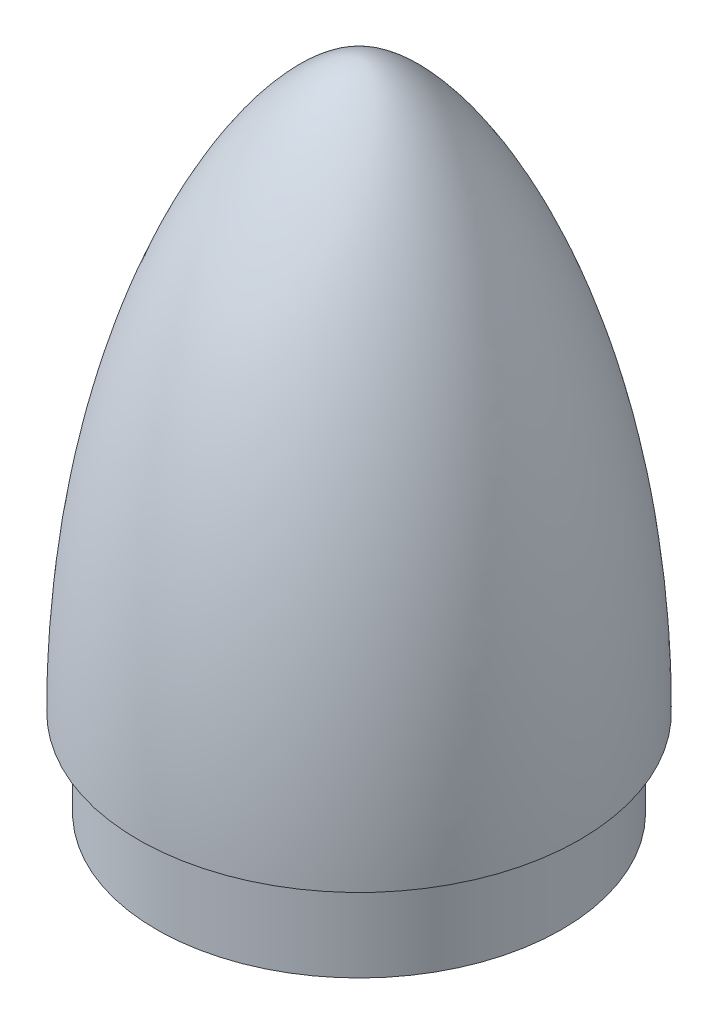
ISO-10303-21;
HEADER;
FILE_DESCRIPTION(('STEP AP214'),'2;1');
FILE_NAME('part.step','',(''),(''),'','','');
FILE_SCHEMA(('AUTOMOTIVE_DESIGN { 1 0 10303 214 1 1 1 1 }'));
ENDSEC;
DATA;
#1=APPLICATION_CONTEXT('core data for automotive mechanical design processes');
#2=APPLICATION_PROTOCOL_DEFINITION('international standard','automotive_design',2000,#1);
#3=PRODUCT_CONTEXT('',#1,'mechanical');
#4=PRODUCT('Part','Part','',(#3));
#5=PRODUCT_RELATED_PRODUCT_CATEGORY('part','',(#4));
#6=PRODUCT_DEFINITION_FORMATION('','',#4);
#7=PRODUCT_DEFINITION_CONTEXT('part definition',#1,'design');
#8=PRODUCT_DEFINITION('design','',#6,#7);
#9=PRODUCT_DEFINITION_SHAPE('','',#8);
#10=(LENGTH_UNIT() NAMED_UNIT(*) SI_UNIT(.MILLI.,.METRE.));
#11=(NAMED_UNIT(*) PLANE_ANGLE_UNIT() SI_UNIT($,.RADIAN.));
#12=(NAMED_UNIT(*) SI_UNIT($,.STERADIAN.) SOLID_ANGLE_UNIT());
#13=UNCERTAINTY_MEASURE_WITH_UNIT(LENGTH_MEASURE(1.E-05),#10,'distance_accuracy_value','');
#14=(GEOMETRIC_REPRESENTATION_CONTEXT(3) GLOBAL_UNCERTAINTY_ASSIGNED_CONTEXT((#13)) GLOBAL_UNIT_ASSIGNED_CONTEXT((#10,
#11,#12)) REPRESENTATION_CONTEXT('',''));
#15=CARTESIAN_POINT('',(0.,0.,0.));
#16=DIRECTION('',(0.,0.,1.));
#17=DIRECTION('',(1.,0.,0.));
#18=AXIS2_PLACEMENT_3D('',#15,#16,#17);
#19=CARTESIAN_POINT('',(23.3,11.2,0.));
#20=DIRECTION('',(0.,1.,0.));
#21=DIRECTION('',(-1.,0.,0.));
#22=AXIS2_PLACEMENT_3D('',#19,#20,#21);
#23=PLANE('',#22);
#24=DIRECTION('',(1.,0.,0.));
#25=VECTOR('',#24,1.);
#26=CARTESIAN_POINT('',(-24.1741484317915,11.2,-1.));
#27=LINE('',#26,#25);
#28=CARTESIAN_POINT('',(22.0773639730834,11.2,-1.));
#29=VERTEX_POINT('',#28);
#30=CARTESIAN_POINT('',(24.1741484317915,11.2,-1.));
#31=VERTEX_POINT('',#30);
#32=EDGE_CURVE('E173',#29,#31,#27,.T.);
#33=ORIENTED_EDGE('',*,*,#32,.T.);
#34=CARTESIAN_POINT('',(0.,11.2,0.));
#35=DIRECTION('',(0.,-1.,0.));
#36=DIRECTION('',(1.,0.,0.));
#37=AXIS2_PLACEMENT_3D('',#34,#35,#36);
#38=CIRCLE('',#37,24.1948228429614);
#39=CARTESIAN_POINT('',(-24.1741484317915,11.2,-1.));
#40=VERTEX_POINT('',#39);
#41=EDGE_CURVE('E257',#40,#31,#38,.T.);
#42=ORIENTED_EDGE('',*,*,#41,.F.);
#43=CARTESIAN_POINT('',(-22.0773639730834,11.2,-1.));
#44=VERTEX_POINT('',#43);
#45=EDGE_CURVE('E243',#40,#44,#27,.T.);
#46=ORIENTED_EDGE('',*,*,#45,.T.);
#47=CARTESIAN_POINT('',(0.,11.2,0.));
#48=DIRECTION('',(0.,1.,0.));
#49=DIRECTION('',(-1.,0.,0.));
#50=AXIS2_PLACEMENT_3D('',#47,#48,#49);
#51=CIRCLE('',#50,22.1);
#52=EDGE_CURVE('E50',#44,#29,#51,.F.);
#53=ORIENTED_EDGE('',*,*,#52,.T.);
#54=EDGE_LOOP('',(#33,#42,#46,#53));
#55=FACE_BOUND('',#54,.T.);
#56=ADVANCED_FACE('F41',(#55),#23,.T.);
#57=CARTESIAN_POINT('',(0.,75.,0.));
#58=CARTESIAN_POINT('',(8.33333333333328,75.,0.));
#59=CARTESIAN_POINT('',(25.4,50.0000000000003,0.));
#60=CARTESIAN_POINT('',(25.4,9.99999999999995,0.));
#61=(BOUNDED_CURVE() B_SPLINE_CURVE(3,(#57,#58,#59,#60),.UNSPECIFIED.,.F.,
.F.) B_SPLINE_CURVE_WITH_KNOTS((4,4),(0.,1.),
.UNSPECIFIED.) CURVE() GEOMETRIC_REPRESENTATION_ITEM() RATIONAL_B_SPLINE_CURVE((1.,1.,1.,1.)) REPRESENTATION_ITEM(''));
#62=CARTESIAN_POINT('',(0.,75.,0.));
#63=DIRECTION('',(0.,-1.,0.));
#64=AXIS1_PLACEMENT('',#62,#63);
#65=SURFACE_OF_REVOLUTION('',#61,#64);
#66=OFFSET_SURFACE('',#65,-1.2,.F.);
#67=CARTESIAN_POINT('',(24.1741484317915,11.2,-1.));
#68=CARTESIAN_POINT('',(24.1639942726645,12.3736738048413,-1.));
#69=CARTESIAN_POINT('',(24.1389042804978,13.5472388097255,-1.));
#70=CARTESIAN_POINT('',(24.0581480548474,15.8935638942139,-1.));
#71=CARTESIAN_POINT('',(24.0024752984746,17.0663237486435,-1.));
#72=CARTESIAN_POINT('',(23.8598479906583,19.410027138415,-1.));
#73=CARTESIAN_POINT('',(23.7728913706183,20.5809705485041,-1.));
#74=CARTESIAN_POINT('',(23.5666593933699,22.923379803315,-1.));
#75=CARTESIAN_POINT('',(23.4472925645998,24.094837612553,-1.));
#76=CARTESIAN_POINT('',(23.1755564957163,26.433869332952,-1.));
#77=CARTESIAN_POINT('',(23.0231890233108,27.6014434487464,-1.));
#78=CARTESIAN_POINT('',(22.6845803030227,29.9316454123773,-0.999999999999999));
#79=CARTESIAN_POINT('',(22.4983395472117,31.0942733318154,-0.999999999999997));
#80=CARTESIAN_POINT('',(22.0202706556455,33.8162548575349,-0.999999999999996));
#81=CARTESIAN_POINT('',(21.7142366674177,35.3731446287377,-0.999999999999999));
#82=CARTESIAN_POINT('',(21.0361429392846,38.4728330343382,-1.));
#83=CARTESIAN_POINT('',(20.6640691193769,40.0156285898819,-1.));
#84=CARTESIAN_POINT('',(19.8503438556694,43.0838999604935,-1.));
#85=CARTESIAN_POINT('',(19.4086514898593,44.6093650196651,-1.));
#86=CARTESIAN_POINT('',(18.6900477834926,46.8826676512257,-1.));
#87=CARTESIAN_POINT('',(18.4406738109487,47.6392890179999,-1.));
#88=CARTESIAN_POINT('',(17.922696231231,49.1459091027078,-1.));
#89=CARTESIAN_POINT('',(17.6540934534144,49.895908104705,-1.));
#90=CARTESIAN_POINT('',(17.0969998714553,51.3881140903452,-1.));
#91=CARTESIAN_POINT('',(16.8085178444764,52.1303243482132,-1.));
#92=CARTESIAN_POINT('',(16.2106217397485,53.6063067661789,-1.));
#93=CARTESIAN_POINT('',(15.9012070481617,54.3400786780882,-1.));
#94=CARTESIAN_POINT('',(15.2607065978334,55.7971027853509,-0.999999999999999));
#95=CARTESIAN_POINT('',(14.9296463608352,56.5203661831969,-0.999999999999998));
#96=CARTESIAN_POINT('',(14.2441954517494,57.9557022318114,-1.));
#97=CARTESIAN_POINT('',(13.8898070856223,58.667775980071,-1.00000000000001));
#98=CARTESIAN_POINT('',(13.2463911344784,59.9050010275431,-1.00000000000001));
#99=CARTESIAN_POINT('',(12.9627790862713,60.4329712103894,-1.));
#100=CARTESIAN_POINT('',(12.3803626082366,61.4805584497362,-0.999999999999998));
#101=CARTESIAN_POINT('',(12.081556562721,62.0001746101278,-1.));
#102=CARTESIAN_POINT('',(11.4674602599168,63.0300674003089,-1.));
#103=CARTESIAN_POINT('',(11.1521591152464,63.5403375536485,-1.));
#104=CARTESIAN_POINT('',(10.5033643962672,64.5503057886138,-1.));
#105=CARTESIAN_POINT('',(10.1698437241366,65.049986499427,-1.));
#106=CARTESIAN_POINT('',(9.48627212420787,66.031474473349,-1.));
#107=CARTESIAN_POINT('',(9.13639258229692,66.513400364719,-1.));
#108=CARTESIAN_POINT('',(8.59552483407501,67.2239626326943,-1.));
#109=CARTESIAN_POINT('',(8.41257847963364,67.4587411830051,-1.));
#110=CARTESIAN_POINT('',(8.04095730102719,67.9237136381775,-1.));
#111=CARTESIAN_POINT('',(7.85228275112115,68.1539077616648,-1.));
#112=CARTESIAN_POINT('',(7.4691426512131,68.6087057218199,-1.));
#113=CARTESIAN_POINT('',(7.27468844694246,68.8333191029233,-1.));
#114=CARTESIAN_POINT('',(6.87918348840871,69.2766437309895,-1.));
#115=CARTESIAN_POINT('',(6.67813323774763,69.4953554262276,-1.));
#116=CARTESIAN_POINT('',(6.26917972248559,69.9256073287795,-1.));
#117=CARTESIAN_POINT('',(6.06128828665294,70.137158751236,-0.999999999999999));
#118=CARTESIAN_POINT('',(5.63767169756198,70.5522380087866,-1.));
#119=CARTESIAN_POINT('',(5.42194764156628,70.7557669594716,-1.));
#120=CARTESIAN_POINT('',(4.98163088150989,71.1533753895715,-1.));
#121=CARTESIAN_POINT('',(4.75703147975243,71.3474474759487,-1.));
#122=CARTESIAN_POINT('',(4.29796065400101,71.7238779933168,-0.999999999999999));
#123=CARTESIAN_POINT('',(4.06348496875789,71.9062312805773,-1.));
#124=CARTESIAN_POINT('',(3.70351923351359,72.1684577056363,-1.));
#125=CARTESIAN_POINT('',(3.58213999739629,72.2539923276645,-1.));
#126=CARTESIAN_POINT('',(3.33644978073532,72.4207313611176,-1.));
#127=CARTESIAN_POINT('',(3.21213912302124,72.5019362461824,-1.));
#128=CARTESIAN_POINT('',(2.96046898091645,72.659300383487,-1.));
#129=CARTESIAN_POINT('',(2.83311158071216,72.7354629578399,-1.));
#130=CARTESIAN_POINT('',(2.57509201411336,72.8819359584576,-1.));
#131=CARTESIAN_POINT('',(2.44443050880844,72.9522475435034,-1.));
#132=CARTESIAN_POINT('',(2.17876160426905,73.0863611326541,-1.));
#133=CARTESIAN_POINT('',(2.04373217322909,73.1501197762908,-1.));
#134=CARTESIAN_POINT('',(1.76993676500968,73.2691806075087,-0.999999999999999));
#135=CARTESIAN_POINT('',(1.6311703021423,73.3244816895935,-0.999999999999998));
#136=CARTESIAN_POINT('',(1.35059386678707,73.4244627982564,-1.));
#137=CARTESIAN_POINT('',(1.20880230817291,73.4691939262656,-1.00000000000001));
#138=CARTESIAN_POINT('',(0.921777642420606,73.5459300765969,-0.999999999999994));
#139=CARTESIAN_POINT('',(0.776546260008409,73.5779413392822,-0.999999999999978));
#140=CARTESIAN_POINT('',(0.554589619324789,73.614660687757,-0.999999999999987));
#141=CARTESIAN_POINT('',(0.478791382609629,73.6250814597416,-0.999999999999997));
#142=CARTESIAN_POINT('',(0.326711140755808,73.6414512651248,-1.));
#143=CARTESIAN_POINT('',(0.250429188371628,73.6474007779835,-1.));
#144=CARTESIAN_POINT('',(0.0976664467864248,73.6545861156783,-0.999999999999999));
#145=CARTESIAN_POINT('',(0.0211857292079774,73.6558234517748,-1.));
#146=CARTESIAN_POINT('',(-0.131728945359874,73.6535342554432,-1.));
#147=CARTESIAN_POINT('',(-0.208162878210516,73.6500061322885,-1.));
#148=CARTESIAN_POINT('',(-0.360699138345236,73.6383322194305,-1.));
#149=CARTESIAN_POINT('',(-0.436801349627685,73.6301849274643,-1.));
#150=CARTESIAN_POINT('',(-0.588420257721416,73.6095761272734,-1.));
#151=CARTESIAN_POINT('',(-0.663936859846094,73.5971139356574,-0.999999999999999));
#152=CARTESIAN_POINT('',(-0.896007046933323,73.5525408769883,-0.999999999999999));
#153=CARTESIAN_POINT('',(-1.05131060454202,73.5138066224215,-1.));
#154=CARTESIAN_POINT('',(-1.35778822604039,73.4226081541661,-1.));
#155=CARTESIAN_POINT('',(-1.5089598611128,73.3701360489924,-1.));
#156=CARTESIAN_POINT('',(-1.80777090729819,73.2539467502061,-1.));
#157=CARTESIAN_POINT('',(-1.9553880498331,73.1901728927491,-1.));
#158=CARTESIAN_POINT('',(-2.24635410491249,73.0536910296806,-1.));
#159=CARTESIAN_POINT('',(-2.38970388264907,72.9809848506019,-1.));
#160=CARTESIAN_POINT('',(-2.65342034932031,72.8384565820216,-1.));
#161=CARTESIAN_POINT('',(-2.77428947159544,72.7695570951908,-1.));
#162=CARTESIAN_POINT('',(-3.01319931074656,72.6270043553253,-1.));
#163=CARTESIAN_POINT('',(-3.131239666418,72.5533504995946,-1.));
#164=CARTESIAN_POINT('',(-3.48165878707921,72.3260386902096,-1.));
#165=CARTESIAN_POINT('',(-3.71003766479565,72.1661952570936,-1.));
#166=CARTESIAN_POINT('',(-4.15739438581791,71.8337031224409,-1.));
#167=CARTESIAN_POINT('',(-4.37636581830571,71.6610459006689,-1.));
#168=CARTESIAN_POINT('',(-4.8063300799609,71.3050554558449,-1.));
#169=CARTESIAN_POINT('',(-5.01730188112183,71.1216969327703,-1.));
#170=CARTESIAN_POINT('',(-5.43135331884439,70.7466803622374,-1.));
#171=CARTESIAN_POINT('',(-5.63443992158367,70.5550299720703,-1.));
#172=CARTESIAN_POINT('',(-6.0335841952389,70.1646510785364,-1.));
#173=CARTESIAN_POINT('',(-6.22964339356886,69.9659241322165,-1.));
#174=CARTESIAN_POINT('',(-6.62683809206382,69.5503691407497,-1.));
#175=CARTESIAN_POINT('',(-6.82758194111303,69.3331674995285,-1.));
#176=CARTESIAN_POINT('',(-7.22248699679851,68.8928428121413,-1.));
#177=CARTESIAN_POINT('',(-7.41664767075844,68.6697192893992,-1.));
#178=CARTESIAN_POINT('',(-7.79906517727266,68.2180638431068,-1.));
#179=CARTESIAN_POINT('',(-7.9873154344562,67.98952635997,-1.));
#180=CARTESIAN_POINT('',(-8.35811059317775,67.5278627195935,-1.));
#181=CARTESIAN_POINT('',(-8.54065521789858,67.2947363406082,-1.));
#182=CARTESIAN_POINT('',(-9.0806704491875,66.5887101348703,-1.));
#183=CARTESIAN_POINT('',(-9.43011407911402,66.1096496260009,-1.));
#184=CARTESIAN_POINT('',(-10.1098932642473,65.1381428293131,-1.));
#185=CARTESIAN_POINT('',(-10.4402261672004,64.6456946973872,-1.));
#186=CARTESIAN_POINT('',(-11.08436887706,63.6482289326945,-1.));
#187=CARTESIAN_POINT('',(-11.3981312609144,63.1431807346211,-1.));
#188=CARTESIAN_POINT('',(-12.0092654166511,62.1239116732894,-1.));
#189=CARTESIAN_POINT('',(-12.3066518228064,61.6096995617636,-1.));
#190=CARTESIAN_POINT('',(-12.8863455732383,60.5731020647985,-1.));
#191=CARTESIAN_POINT('',(-13.1686583257886,60.0507196989288,-0.999999999999999));
#192=CARTESIAN_POINT('',(-13.7192113504674,58.9986261762725,-1.));
#193=CARTESIAN_POINT('',(-13.9874520133469,58.4689152235015,-1.));
#194=CARTESIAN_POINT('',(-14.607211196667,57.206184965111,-1.00000000000001));
#195=CARTESIAN_POINT('',(-14.9529133343658,56.470306837132,-1.));
#196=CARTESIAN_POINT('',(-15.6209698761327,54.9879813355414,-0.999999999999999));
#197=CARTESIAN_POINT('',(-15.9433221420245,54.2415330014664,-1.));
#198=CARTESIAN_POINT('',(-16.566182480643,52.7388245614912,-1.));
#199=CARTESIAN_POINT('',(-16.8666711971157,51.9825564433905,-1.));
#200=CARTESIAN_POINT('',(-17.4465473330884,50.4619407118569,-1.));
#201=CARTESIAN_POINT('',(-17.72593360789,49.6975926626896,-1.));
#202=CARTESIAN_POINT('',(-18.2645455334596,48.1615526459238,-1.));
#203=CARTESIAN_POINT('',(-18.5237646197317,47.3898583780819,-1.));
#204=CARTESIAN_POINT('',(-19.0226793188364,45.8401731911368,-1.));
#205=CARTESIAN_POINT('',(-19.2623741186609,45.0621820113062,-1.));
#206=CARTESIAN_POINT('',(-19.9531853888868,42.7196958055932,-1.));
#207=CARTESIAN_POINT('',(-20.3759995166317,41.1467720017985,-1.));
#208=CARTESIAN_POINT('',(-21.150027171661,37.9843913962297,-1.));
#209=CARTESIAN_POINT('',(-21.5012759371144,36.3949431381503,-0.999999999999999));
#210=CARTESIAN_POINT('',(-22.1356643061081,33.2028606383602,-1.));
#211=CARTESIAN_POINT('',(-22.4188185047148,31.6002292985436,-1.));
#212=CARTESIAN_POINT('',(-22.8311227434455,28.9540367127018,-1.));
#213=CARTESIAN_POINT('',(-22.979307363631,27.913389355387,-1.));
#214=CARTESIAN_POINT('',(-23.2490558305658,25.828680789952,-0.999999999999999));
#215=CARTESIAN_POINT('',(-23.3706207471652,24.7846197207417,-1.));
#216=CARTESIAN_POINT('',(-23.5877309116508,22.6937942974478,-1.));
#217=CARTESIAN_POINT('',(-23.6832758743477,21.6470299138617,-1.));
#218=CARTESIAN_POINT('',(-23.8484715796195,19.5569025847651,-1.));
#219=CARTESIAN_POINT('',(-23.9182534923979,18.5135499882859,-1.));
#220=CARTESIAN_POINT('',(-24.0331288103008,16.4255130974228,-1.));
#221=CARTESIAN_POINT('',(-24.0782227009381,15.3808288296324,-1.));
#222=CARTESIAN_POINT('',(-24.1442097509505,13.2907929421711,-0.999999999999999));
#223=CARTESIAN_POINT('',(-24.1651051925981,12.2454413947408,-0.999999999999996));
#224=CARTESIAN_POINT('',(-24.1741484317915,11.2,-0.99999999999999));
#225=B_SPLINE_CURVE_WITH_KNOTS('',3,(#67,#68,#69,#70,#71,#72,#73,#74,#75,#76,#77,#78,#79,#80,
#81,#82,#83,#84,#85,#86,#87,#88,#89,#90,#91,#92,#93,#94,#95,#96,#97,#98,#99,#100,#101,#102,#103,
#104,#105,#106,#107,#108,#109,#110,#111,#112,#113,#114,#115,#116,#117,#118,#119,#120,#121,#122,
#123,#124,#125,#126,#127,#128,#129,#130,#131,#132,#133,#134,#135,#136,#137,#138,#139,#140,#141,
#142,#143,#144,#145,#146,#147,#148,#149,#150,#151,#152,#153,#154,#155,#156,#157,#158,#159,#160,
#161,#162,#163,#164,#165,#166,#167,#168,#169,#170,#171,#172,#173,#174,#175,#176,#177,#178,#179,
#180,#181,#182,#183,#184,#185,#186,#187,#188,#189,#190,#191,#192,#193,#194,#195,#196,#197,#198,
#199,#200,#201,#202,#203,#204,#205,#206,#207,#208,#209,#210,#211,#212,#213,#214,#215,#216,#217,
#218,#219,#220,#221,#222,#223,#224),.UNSPECIFIED.,.F.,.F.,(4,2,2,2,2,2,2,2,2,2,2,2,2,2,2,2,2,2,
2,2,2,2,2,2,2,2,2,2,2,2,2,2,2,2,2,2,2,2,2,2,2,2,2,2,2,2,2,2,2,2,2,2,2,2,2,2,2,2,2,2,2,2,2,2,2,2,
2,2,2,2,2,2,2,2,2,2,2,2,4),(0.,3.52108827610532,7.04292784438293,10.5650003316089,
14.0971184137333,17.6290473416946,21.1609249660086,25.9195409146875,30.6791726440044,
35.4416126063587,37.8313738694899,40.2210321219031,42.6096419609773,44.9983218749699,
47.3842344457051,49.769911524679,51.5676602766539,53.3656005977031,55.1647429782515,
56.9666382025388,58.7526693651001,59.6455200676623,60.5383280888257,61.4294862530565,
62.3205765358038,63.2101996097993,64.0996985347715,64.9898820342836,65.8804536301502,
66.3258479607377,66.7711934682222,67.21624257939,67.6612033383183,68.108940828191,
68.5567367923519,69.0023214017273,69.4476871366825,69.6771093405041,69.9065069395083,
70.1358309613286,70.365231551221,70.5947067904467,70.8242183904695,71.3035100731783,
71.7830776835975,72.2651214888343,72.7470668865227,73.1643283909064,73.5816428944428,
74.417290786682,75.2534993899105,76.0917720377887,76.9292864328909,77.7666176756395,
78.6537514310425,79.5409567982214,80.4291165236966,81.3173192728757,83.0956280760341,
84.8741830899688,86.6575792971098,88.4393550213396,90.2204871064109,92.00156970713,
94.4402132295942,96.8790797800703,99.3200798799178,101.761212296446,104.203136014875,
106.645161365198,111.529478265351,116.411384326548,121.292243088705,124.44536813772,
127.598366438897,130.751399296834,133.888149850236,137.024838714311,140.16123171804),.UNSPECIFIED.);
#226=EDGE_CURVE('E208',#31,#40,#225,.T.);
#227=ORIENTED_EDGE('',*,*,#226,.T.);
#228=ORIENTED_EDGE('',*,*,#41,.T.);
#229=EDGE_LOOP('',(#227,#228));
#230=FACE_BOUND('',#229,.T.);
#231=ADVANCED_FACE('F287',(#230),#66,.F.);
#232=CARTESIAN_POINT('',(0.,0.,0.));
#233=DIRECTION('',(0.,1.,0.));
#234=DIRECTION('',(-1.,0.,0.));
#235=AXIS2_PLACEMENT_3D('',#232,#233,#234);
#236=PLANE('',#235);
#237=CARTESIAN_POINT('',(0.,0.,0.));
#238=DIRECTION('',(0.,-1.,0.));
#239=DIRECTION('',(1.,0.,0.));
#240=AXIS2_PLACEMENT_3D('',#237,#238,#239);
#241=CIRCLE('',#240,22.1);
#242=CARTESIAN_POINT('',(22.1,0.,0.));
#243=VERTEX_POINT('',#242);
#244=EDGE_CURVE('E11',#243,#243,#241,.T.);
#245=ORIENTED_EDGE('',*,*,#244,.F.);
#246=EDGE_LOOP('',(#245));
#247=FACE_BOUND('',#246,.T.);
#248=CARTESIAN_POINT('',(0.,0.,0.));
#249=DIRECTION('',(0.,-1.,0.));
#250=DIRECTION('',(1.,0.,0.));
#251=AXIS2_PLACEMENT_3D('',#248,#249,#250);
#252=CIRCLE('',#251,23.3);
#253=CARTESIAN_POINT('',(23.3,0.,0.));
#254=VERTEX_POINT('',#253);
#255=EDGE_CURVE('E45',#254,#254,#252,.T.);
#256=ORIENTED_EDGE('',*,*,#255,.T.);
#257=EDGE_LOOP('',(#256));
#258=FACE_BOUND('',#257,.T.);
#259=ADVANCED_FACE('F43',(#247,#258),#236,.F.);
#260=CARTESIAN_POINT('',(0.,75.,0.));
#261=DIRECTION('',(0.,-1.,0.));
#262=DIRECTION('',(1.,0.,0.));
#263=AXIS2_PLACEMENT_3D('',#260,#261,#262);
#264=CYLINDRICAL_SURFACE('',#263,22.1);
#265=ORIENTED_EDGE('',*,*,#244,.T.);
#266=EDGE_LOOP('',(#265));
#267=FACE_BOUND('',#266,.T.);
#268=ORIENTED_EDGE('',*,*,#52,.F.);
#269=CARTESIAN_POINT('',(0.,11.2,0.));
#270=DIRECTION('',(0.,-1.,0.));
#271=DIRECTION('',(1.,0.,0.));
#272=AXIS2_PLACEMENT_3D('',#269,#270,#271);
#273=CIRCLE('',#272,22.1);
#274=CARTESIAN_POINT('',(-22.0773639730834,11.2,1.));
#275=VERTEX_POINT('',#274);
#276=EDGE_CURVE('E252',#275,#44,#273,.T.);
#277=ORIENTED_EDGE('',*,*,#276,.F.);
#278=CARTESIAN_POINT('',(22.0773639730834,11.2,1.));
#279=VERTEX_POINT('',#278);
#280=EDGE_CURVE('E255',#279,#275,#51,.F.);
#281=ORIENTED_EDGE('',*,*,#280,.F.);
#282=EDGE_CURVE('E249',#29,#279,#273,.T.);
#283=ORIENTED_EDGE('',*,*,#282,.F.);
#284=EDGE_LOOP('',(#268,#277,#281,#283));
#285=FACE_BOUND('',#284,.T.);
#286=ADVANCED_FACE('F297',(#267,#285),#264,.F.);
#287=DIRECTION('',(-1.,0.,0.));
#288=VECTOR('',#287,1.);
#289=CARTESIAN_POINT('',(-24.1741484317915,11.2,1.));
#290=LINE('',#289,#288);
#291=CARTESIAN_POINT('',(-24.1741484317915,11.2,1.));
#292=VERTEX_POINT('',#291);
#293=EDGE_CURVE('E245',#275,#292,#290,.T.);
#294=ORIENTED_EDGE('',*,*,#293,.T.);
#295=CARTESIAN_POINT('',(24.1741484317915,11.2,1.));
#296=VERTEX_POINT('',#295);
#297=EDGE_CURVE('E256',#296,#292,#38,.T.);
#298=ORIENTED_EDGE('',*,*,#297,.F.);
#299=EDGE_CURVE('E242',#296,#279,#290,.T.);
#300=ORIENTED_EDGE('',*,*,#299,.T.);
#301=ORIENTED_EDGE('',*,*,#280,.T.);
#302=EDGE_LOOP('',(#294,#298,#300,#301));
#303=FACE_BOUND('',#302,.T.);
#304=ADVANCED_FACE('F285',(#303),#23,.T.);
#305=CARTESIAN_POINT('',(-24.1741484317915,11.2,1.));
#306=CARTESIAN_POINT('',(-24.1639942726645,12.3736738048413,1.));
#307=CARTESIAN_POINT('',(-24.1389042804978,13.5472388097255,1.));
#308=CARTESIAN_POINT('',(-24.0581480548475,15.8935638942139,1.));
#309=CARTESIAN_POINT('',(-24.0024752984746,17.0663237486435,1.));
#310=CARTESIAN_POINT('',(-23.8598479906583,19.410027138415,1.));
#311=CARTESIAN_POINT('',(-23.7728913706183,20.5809705485041,1.));
#312=CARTESIAN_POINT('',(-23.5666593933699,22.923379803315,1.));
#313=CARTESIAN_POINT('',(-23.4472925645998,24.094837612553,0.999999999999999));
#314=CARTESIAN_POINT('',(-23.1755564957164,26.433869332952,1.));
#315=CARTESIAN_POINT('',(-23.0231890233108,27.6014434487464,1.));
#316=CARTESIAN_POINT('',(-22.6845803030227,29.9316454123773,0.999999999999998));
#317=CARTESIAN_POINT('',(-22.4983395472117,31.0942733318154,0.999999999999992));
#318=CARTESIAN_POINT('',(-22.0202706556455,33.8162548575348,0.99999999999999));
#319=CARTESIAN_POINT('',(-21.7142366674178,35.3731446287377,0.999999999999997));
#320=CARTESIAN_POINT('',(-21.0361429392846,38.4728330343382,1.));
#321=CARTESIAN_POINT('',(-20.664069119377,40.0156285898818,1.));
#322=CARTESIAN_POINT('',(-19.8503438556694,43.0838999604935,0.999999999999999));
#323=CARTESIAN_POINT('',(-19.4086514898593,44.6093650196651,1.));
#324=CARTESIAN_POINT('',(-18.6900477834926,46.8826676512257,1.));
#325=CARTESIAN_POINT('',(-18.4406738109488,47.6392890179999,1.));
#326=CARTESIAN_POINT('',(-17.922696231231,49.1459091027078,1.));
#327=CARTESIAN_POINT('',(-17.6540934534144,49.895908104705,1.));
#328=CARTESIAN_POINT('',(-17.0969998714554,51.3881140903452,1.));
#329=CARTESIAN_POINT('',(-16.8085178444765,52.1303243482132,1.));
#330=CARTESIAN_POINT('',(-16.2106217397485,53.6063067661789,1.));
#331=CARTESIAN_POINT('',(-15.9012070481617,54.3400786780882,1.));
#332=CARTESIAN_POINT('',(-15.2607065978335,55.7971027853509,1.));
#333=CARTESIAN_POINT('',(-14.9296463608352,56.5203661831969,0.999999999999999));
#334=CARTESIAN_POINT('',(-14.2441954517494,57.9557022318114,1.));
#335=CARTESIAN_POINT('',(-13.8898070856223,58.667775980071,1.));
#336=CARTESIAN_POINT('',(-13.2463911344784,59.9050010275431,1.));
#337=CARTESIAN_POINT('',(-12.9627790862713,60.4329712103894,1.));
#338=CARTESIAN_POINT('',(-12.3803626082366,61.4805584497362,1.));
#339=CARTESIAN_POINT('',(-12.0815565627211,62.0001746101278,1.));
#340=CARTESIAN_POINT('',(-11.4674602599168,63.0300674003089,1.));
#341=CARTESIAN_POINT('',(-11.1521591152464,63.5403375536485,1.));
#342=CARTESIAN_POINT('',(-10.5033643962672,64.5503057886138,1.));
#343=CARTESIAN_POINT('',(-10.1698437241366,65.049986499427,1.));
#344=CARTESIAN_POINT('',(-9.48627212420789,66.0314744733491,1.));
#345=CARTESIAN_POINT('',(-9.13639258229696,66.513400364719,1.));
#346=CARTESIAN_POINT('',(-8.59552483407502,67.2239626326944,1.));
#347=CARTESIAN_POINT('',(-8.41257847963363,67.4587411830051,1.));
#348=CARTESIAN_POINT('',(-8.04095730102719,67.9237136381776,1.));
#349=CARTESIAN_POINT('',(-7.85228275112117,68.1539077616648,1.));
#350=CARTESIAN_POINT('',(-7.46914265121311,68.6087057218199,1.));
#351=CARTESIAN_POINT('',(-7.27468844694246,68.8333191029233,1.));
#352=CARTESIAN_POINT('',(-6.8791834884087,69.2766437309895,1.));
#353=CARTESIAN_POINT('',(-6.67813323774763,69.4953554262277,1.));
#354=CARTESIAN_POINT('',(-6.2691797224856,69.9256073287795,1.));
#355=CARTESIAN_POINT('',(-6.06128828665294,70.137158751236,1.));
#356=CARTESIAN_POINT('',(-5.63767169756197,70.5522380087866,1.));
#357=CARTESIAN_POINT('',(-5.42194764156628,70.7557669594717,1.));
#358=CARTESIAN_POINT('',(-4.9816308815099,71.1533753895715,1.));
#359=CARTESIAN_POINT('',(-4.75703147975243,71.3474474759488,1.));
#360=CARTESIAN_POINT('',(-4.29796065400101,71.7238779933169,1.));
#361=CARTESIAN_POINT('',(-4.06348496875789,71.9062312805773,1.));
#362=CARTESIAN_POINT('',(-3.70351923351358,72.1684577056363,1.));
#363=CARTESIAN_POINT('',(-3.58213999739628,72.2539923276645,1.));
#364=CARTESIAN_POINT('',(-3.33644978073532,72.4207313611176,1.));
#365=CARTESIAN_POINT('',(-3.21213912302124,72.5019362461824,1.));
#366=CARTESIAN_POINT('',(-2.96046898091646,72.659300383487,1.));
#367=CARTESIAN_POINT('',(-2.83311158071216,72.73546295784,1.));
#368=CARTESIAN_POINT('',(-2.57509201411336,72.8819359584576,1.));
#369=CARTESIAN_POINT('',(-2.44443050880844,72.9522475435034,0.999999999999999));
#370=CARTESIAN_POINT('',(-2.17876160426905,73.0863611326541,0.999999999999999));
#371=CARTESIAN_POINT('',(-2.04373217322909,73.1501197762908,1.));
#372=CARTESIAN_POINT('',(-1.76993676500968,73.2691806075087,1.));
#373=CARTESIAN_POINT('',(-1.6311703021423,73.3244816895935,1.));
#374=CARTESIAN_POINT('',(-1.35059386678707,73.4244627982565,1.));
#375=CARTESIAN_POINT('',(-1.2088023081729,73.4691939262656,1.));
#376=CARTESIAN_POINT('',(-0.921777642420592,73.5459300765969,1.));
#377=CARTESIAN_POINT('',(-0.776546260008392,73.5779413392822,1.));
#378=CARTESIAN_POINT('',(-0.554589619324768,73.614660687757,1.));
#379=CARTESIAN_POINT('',(-0.478791382609607,73.6250814597416,1.));
#380=CARTESIAN_POINT('',(-0.326711140755786,73.6414512651248,1.));
#381=CARTESIAN_POINT('',(-0.250429188371606,73.6474007779835,1.));
#382=CARTESIAN_POINT('',(-0.0976664467864025,73.6545861156784,1.));
#383=CARTESIAN_POINT('',(-0.0211857292079536,73.6558234517748,1.));
#384=CARTESIAN_POINT('',(0.1317289453599,73.6535342554432,1.));
#385=CARTESIAN_POINT('',(0.208162878210541,73.6500061322885,1.));
#386=CARTESIAN_POINT('',(0.360699138345261,73.6383322194305,1.));
#387=CARTESIAN_POINT('',(0.43680134962771,73.6301849274643,1.));
#388=CARTESIAN_POINT('',(0.588420257721442,73.6095761272734,1.));
#389=CARTESIAN_POINT('',(0.663936859846121,73.5971139356573,1.));
#390=CARTESIAN_POINT('',(0.896007046933355,73.5525408769882,1.));
#391=CARTESIAN_POINT('',(1.05131060454205,73.5138066224214,1.));
#392=CARTESIAN_POINT('',(1.35778822604044,73.4226081541661,1.));
#393=CARTESIAN_POINT('',(1.50895986111285,73.3701360489924,1.));
#394=CARTESIAN_POINT('',(1.80777090729825,73.2539467502061,1.));
#395=CARTESIAN_POINT('',(1.95538804983316,73.190172892749,1.));
#396=CARTESIAN_POINT('',(2.24635410491255,73.0536910296806,1.));
#397=CARTESIAN_POINT('',(2.38970388264912,72.9809848506019,0.999999999999999));
#398=CARTESIAN_POINT('',(2.65342034932038,72.8384565820215,0.999999999999999));
#399=CARTESIAN_POINT('',(2.77428947159553,72.7695570951908,1.));
#400=CARTESIAN_POINT('',(3.01319931074666,72.6270043553252,1.));
#401=CARTESIAN_POINT('',(3.13123966641809,72.5533504995945,1.));
#402=CARTESIAN_POINT('',(3.48165878707929,72.3260386902095,1.));
#403=CARTESIAN_POINT('',(3.71003766479576,72.1661952570936,1.));
#404=CARTESIAN_POINT('',(4.15739438581804,71.8337031224409,1.));
#405=CARTESIAN_POINT('',(4.37636581830583,71.6610459006688,1.));
#406=CARTESIAN_POINT('',(4.80633007996103,71.3050554558447,1.));
#407=CARTESIAN_POINT('',(5.01730188112197,71.1216969327701,1.));
#408=CARTESIAN_POINT('',(5.43135331884454,70.7466803622372,1.));
#409=CARTESIAN_POINT('',(5.63443992158382,70.5550299720701,1.));
#410=CARTESIAN_POINT('',(6.03358419523905,70.1646510785362,1.));
#411=CARTESIAN_POINT('',(6.22964339356902,69.9659241322163,1.));
#412=CARTESIAN_POINT('',(6.62683809206398,69.5503691407495,1.));
#413=CARTESIAN_POINT('',(6.82758194111319,69.3331674995282,1.));
#414=CARTESIAN_POINT('',(7.22248699679868,68.892842812141,1.));
#415=CARTESIAN_POINT('',(7.41664767075862,68.6697192893989,1.));
#416=CARTESIAN_POINT('',(7.79906517727285,68.2180638431065,1.));
#417=CARTESIAN_POINT('',(7.98731543445638,67.9895263599698,1.));
#418=CARTESIAN_POINT('',(8.35811059317794,67.5278627195932,1.));
#419=CARTESIAN_POINT('',(8.54065521789878,67.2947363406079,1.));
#420=CARTESIAN_POINT('',(9.08067044918772,66.5887101348699,1.));
#421=CARTESIAN_POINT('',(9.43011407911425,66.1096496260005,1.));
#422=CARTESIAN_POINT('',(10.1098932642475,65.1381428293127,1.));
#423=CARTESIAN_POINT('',(10.4402261672006,64.6456946973868,1.));
#424=CARTESIAN_POINT('',(11.0843688770603,63.6482289326941,1.));
#425=CARTESIAN_POINT('',(11.3981312609146,63.1431807346206,1.));
#426=CARTESIAN_POINT('',(12.0092654166514,62.1239116732889,1.));
#427=CARTESIAN_POINT('',(12.3066518228067,61.6096995617631,1.));
#428=CARTESIAN_POINT('',(12.8863455732386,60.5731020647979,1.));
#429=CARTESIAN_POINT('',(13.1686583257889,60.0507196989282,1.));
#430=CARTESIAN_POINT('',(13.7192113504677,58.9986261762719,1.));
#431=CARTESIAN_POINT('',(13.9874520133472,58.4689152235008,0.999999999999999));
#432=CARTESIAN_POINT('',(14.6072111966673,57.2061849651103,0.999999999999998));
#433=CARTESIAN_POINT('',(14.9529133343661,56.4703068371313,1.));
#434=CARTESIAN_POINT('',(15.620969876133,54.9879813355407,1.));
#435=CARTESIAN_POINT('',(15.9433221420248,54.2415330014656,1.));
#436=CARTESIAN_POINT('',(16.5661824806433,52.7388245614904,1.));
#437=CARTESIAN_POINT('',(16.866671197116,51.9825564433896,1.));
#438=CARTESIAN_POINT('',(17.4465473330887,50.461940711856,1.));
#439=CARTESIAN_POINT('',(17.7259336078903,49.6975926626887,1.));
#440=CARTESIAN_POINT('',(18.2645455334599,48.1615526459228,1.));
#441=CARTESIAN_POINT('',(18.523764619732,47.389858378081,1.));
#442=CARTESIAN_POINT('',(19.0226793188367,45.8401731911358,1.));
#443=CARTESIAN_POINT('',(19.2623741186612,45.0621820113051,1.));
#444=CARTESIAN_POINT('',(19.953185388887,42.7196958055921,1.));
#445=CARTESIAN_POINT('',(20.3759995166319,41.1467720017974,1.));
#446=CARTESIAN_POINT('',(21.1500271716612,37.9843913962285,1.));
#447=CARTESIAN_POINT('',(21.5012759371146,36.3949431381491,1.));
#448=CARTESIAN_POINT('',(22.1356643061083,33.2028606383588,1.));
#449=CARTESIAN_POINT('',(22.418818504715,31.6002292985422,1.));
#450=CARTESIAN_POINT('',(22.8311227434457,28.9540367127005,1.));
#451=CARTESIAN_POINT('',(22.9793073636311,27.9133893553857,1.));
#452=CARTESIAN_POINT('',(23.2490558305659,25.8286807899509,1.));
#453=CARTESIAN_POINT('',(23.3706207471653,24.7846197207407,1.));
#454=CARTESIAN_POINT('',(23.5877309116509,22.693794297447,1.));
#455=CARTESIAN_POINT('',(23.6832758743478,21.647029913861,1.));
#456=CARTESIAN_POINT('',(23.8484715796195,19.5569025847644,1.));
#457=CARTESIAN_POINT('',(23.9182534923979,18.5135499882854,1.));
#458=CARTESIAN_POINT('',(24.0331288103008,16.4255130974224,1.));
#459=CARTESIAN_POINT('',(24.0782227009381,15.3808288296321,1.));
#460=CARTESIAN_POINT('',(24.1442097509505,13.2907929421709,1.));
#461=CARTESIAN_POINT('',(24.1651051925981,12.2454413947407,1.));
#462=CARTESIAN_POINT('',(24.1741484317915,11.2,1.));
#463=B_SPLINE_CURVE_WITH_KNOTS('',3,(#305,#306,#307,#308,#309,#310,#311,#312,#313,#314,#315,
#316,#317,#318,#319,#320,#321,#322,#323,#324,#325,#326,#327,#328,#329,#330,#331,#332,#333,#334,
#335,#336,#337,#338,#339,#340,#341,#342,#343,#344,#345,#346,#347,#348,#349,#350,#351,#352,#353,
#354,#355,#356,#357,#358,#359,#360,#361,#362,#363,#364,#365,#366,#367,#368,#369,#370,#371,#372,
#373,#374,#375,#376,#377,#378,#379,#380,#381,#382,#383,#384,#385,#386,#387,#388,#389,#390,#391,
#392,#393,#394,#395,#396,#397,#398,#399,#400,#401,#402,#403,#404,#405,#406,#407,#408,#409,#410,
#411,#412,#413,#414,#415,#416,#417,#418,#419,#420,#421,#422,#423,#424,#425,#426,#427,#428,#429,
#430,#431,#432,#433,#434,#435,#436,#437,#438,#439,#440,#441,#442,#443,#444,#445,#446,#447,#448,
#449,#450,#451,#452,#453,#454,#455,#456,#457,#458,#459,#460,#461,#462),.UNSPECIFIED.,.F.,.F.,(4,
2,2,2,2,2,2,2,2,2,2,2,2,2,2,2,2,2,2,2,2,2,2,2,2,2,2,2,2,2,2,2,2,2,2,2,2,2,2,2,2,2,2,2,2,2,2,2,2,
2,2,2,2,2,2,2,2,2,2,2,2,2,2,2,2,2,2,2,2,2,2,2,2,2,2,2,2,2,4),(0.,3.52108827610531,
7.04292784438292,10.5650003316089,14.0971184137333,17.6290473416946,21.1609249660086,
25.9195409146874,30.6791726440044,35.4416126063586,37.8313738694899,40.221032121903,
42.6096419609773,44.9983218749699,47.3842344457051,49.769911524679,51.5676602766539,
53.3656005977031,55.1647429782515,56.9666382025388,58.7526693651001,59.6455200676623,
60.5383280888257,61.4294862530566,62.3205765358039,63.2101996097993,64.0996985347715,
64.9898820342836,65.8804536301502,66.3258479607377,66.7711934682223,67.2162425793901,
67.6612033383183,68.108940828191,68.556736792352,69.0023214017273,69.4476871366826,
69.6771093405041,69.9065069395084,70.1358309613287,70.365231551221,70.5947067904467,
70.8242183904695,71.3035100731783,71.7830776835975,72.2651214888344,72.7470668865228,
73.1643283909066,73.581642894443,74.4172907866822,75.2534993899108,76.0917720377889,
76.9292864328912,77.7666176756398,78.6537514310428,79.5409567982217,80.429116523697,
81.3173192728761,83.0956280760345,84.8741830899693,86.6575792971104,88.4393550213403,
90.2204871064116,92.0015697071307,94.440213229595,96.8790797800711,99.3200798799188,
101.761212296447,104.203136014876,106.645161365199,111.529478265352,116.411384326549,
121.292243088707,124.445368137721,127.598366438898,130.751399296834,133.888149850236,
137.024838714312,140.16123171804),.UNSPECIFIED.);
#464=EDGE_CURVE('E236',#292,#296,#463,.T.);
#465=ORIENTED_EDGE('',*,*,#464,.T.);
#466=ORIENTED_EDGE('',*,*,#297,.T.);
#467=EDGE_LOOP('',(#465,#466));
#468=FACE_BOUND('',#467,.T.);
#469=ADVANCED_FACE('F274',(#468),#66,.F.);
#470=CARTESIAN_POINT('',(0.,75.,0.));
#471=DIRECTION('',(0.,-1.,0.));
#472=DIRECTION('',(1.,0.,0.));
#473=AXIS2_PLACEMENT_3D('',#470,#471,#472);
#474=CYLINDRICAL_SURFACE('',#473,23.3);
#475=ORIENTED_EDGE('',*,*,#255,.F.);
#476=EDGE_LOOP('',(#475));
#477=FACE_BOUND('',#476,.T.);
#478=CARTESIAN_POINT('',(0.,9.99999999999999,0.));
#479=DIRECTION('',(0.,-1.,0.));
#480=DIRECTION('',(1.,0.,0.));
#481=AXIS2_PLACEMENT_3D('',#478,#479,#480);
#482=CIRCLE('',#481,23.3);
#483=CARTESIAN_POINT('',(23.3,10.,0.));
#484=VERTEX_POINT('',#483);
#485=EDGE_CURVE('E463',#484,#484,#482,.T.);
#486=ORIENTED_EDGE('',*,*,#485,.T.);
#487=EDGE_LOOP('',(#486));
#488=FACE_BOUND('',#487,.T.);
#489=ADVANCED_FACE('F277',(#477,#488),#474,.T.);
#490=CARTESIAN_POINT('',(23.3,10.,0.));
#491=DIRECTION('',(0.,1.,0.));
#492=DIRECTION('',(-1.,0.,0.));
#493=AXIS2_PLACEMENT_3D('',#490,#491,#492);
#494=PLANE('',#493);
#495=ORIENTED_EDGE('',*,*,#485,.F.);
#496=EDGE_LOOP('',(#495));
#497=FACE_BOUND('',#496,.T.);
#498=CARTESIAN_POINT('',(0.,9.99999999999999,0.));
#499=DIRECTION('',(0.,-1.,0.));
#500=DIRECTION('',(1.,0.,0.));
#501=AXIS2_PLACEMENT_3D('',#498,#499,#500);
#502=CIRCLE('',#501,25.4);
#503=CARTESIAN_POINT('',(25.4,10.,0.));
#504=VERTEX_POINT('',#503);
#505=EDGE_CURVE('E263',#504,#504,#502,.T.);
#506=ORIENTED_EDGE('',*,*,#505,.T.);
#507=EDGE_LOOP('',(#506));
#508=FACE_BOUND('',#507,.T.);
#509=ADVANCED_FACE('F272',(#497,#508),#494,.F.);
#510=CARTESIAN_POINT('',(0.,75.,0.));
#511=CARTESIAN_POINT('',(8.33333333333328,75.,0.));
#512=CARTESIAN_POINT('',(25.4,50.0000000000003,0.));
#513=CARTESIAN_POINT('',(25.4,9.99999999999995,0.));
#514=(BOUNDED_CURVE() B_SPLINE_CURVE(3,(#510,#511,#512,#513),.UNSPECIFIED.,.F.,
.F.) B_SPLINE_CURVE_WITH_KNOTS((4,4),(0.,1.),
.UNSPECIFIED.) CURVE() GEOMETRIC_REPRESENTATION_ITEM() RATIONAL_B_SPLINE_CURVE((1.,1.,1.,1.)) REPRESENTATION_ITEM(''));
#515=CARTESIAN_POINT('',(0.,75.,0.));
#516=DIRECTION('',(0.,-1.,0.));
#517=AXIS1_PLACEMENT('',#515,#516);
#518=SURFACE_OF_REVOLUTION('',#514,#517);
#519=ORIENTED_EDGE('',*,*,#505,.F.);
#520=EDGE_LOOP('',(#519));
#521=FACE_BOUND('',#520,.T.);
#522=CARTESIAN_POINT('',(0.,75.,0.));
#523=VERTEX_POINT('',#522);
#524=VERTEX_LOOP('',#523);
#525=FACE_BOUND('',#524,.T.);
#526=ADVANCED_FACE('F227',(#521,#525),#518,.T.);
#527=CARTESIAN_POINT('',(0.,11.2,0.));
#528=DIRECTION('',(0.,-1.,0.));
#529=DIRECTION('',(1.,0.,0.));
#530=AXIS2_PLACEMENT_3D('',#527,#528,#529);
#531=PLANE('',#530);
#532=EDGE_CURVE('E248',#279,#275,#290,.T.);
#533=ORIENTED_EDGE('',*,*,#532,.T.);
#534=ORIENTED_EDGE('',*,*,#276,.T.);
#535=EDGE_CURVE('E246',#44,#29,#27,.T.);
#536=ORIENTED_EDGE('',*,*,#535,.T.);
#537=ORIENTED_EDGE('',*,*,#282,.T.);
#538=EDGE_LOOP('',(#533,#534,#536,#537));
#539=FACE_BOUND('',#538,.T.);
#540=ADVANCED_FACE('F224',(#539),#531,.T.);
#541=CARTESIAN_POINT('',(-24.1741484317915,75.001,-1.));
#542=DIRECTION('',(0.,0.,-1.));
#543=DIRECTION('',(-1.,0.,0.));
#544=AXIS2_PLACEMENT_3D('',#541,#542,#543);
#545=PLANE('',#544);
#546=DIRECTION('',(1.,0.,0.));
#547=VECTOR('',#546,1.);
#548=CARTESIAN_POINT('',(10.5,18.25,-1.));
#549=LINE('',#548,#547);
#550=CARTESIAN_POINT('',(-10.5,18.25,-1.));
#551=VERTEX_POINT('',#550);
#552=CARTESIAN_POINT('',(10.5,18.25,-1.));
#553=VERTEX_POINT('',#552);
#554=EDGE_CURVE('E148',#551,#553,#549,.T.);
#555=ORIENTED_EDGE('',*,*,#554,.T.);
#556=DIRECTION('',(0.,1.,0.));
#557=VECTOR('',#556,1.);
#558=CARTESIAN_POINT('',(10.5,21.75,-1.));
#559=LINE('',#558,#557);
#560=CARTESIAN_POINT('',(10.5,21.75,-1.));
#561=VERTEX_POINT('',#560);
#562=EDGE_CURVE('E135',#553,#561,#559,.T.);
#563=ORIENTED_EDGE('',*,*,#562,.T.);
#564=DIRECTION('',(-1.,0.,0.));
#565=VECTOR('',#564,1.);
#566=CARTESIAN_POINT('',(10.5,21.75,-1.));
#567=LINE('',#566,#565);
#568=CARTESIAN_POINT('',(-10.5,21.75,-1.));
#569=VERTEX_POINT('',#568);
#570=EDGE_CURVE('E167',#561,#569,#567,.T.);
#571=ORIENTED_EDGE('',*,*,#570,.T.);
#572=DIRECTION('',(0.,-1.,0.));
#573=VECTOR('',#572,1.);
#574=CARTESIAN_POINT('',(-10.5,21.75,-1.));
#575=LINE('',#574,#573);
#576=EDGE_CURVE('E156',#569,#551,#575,.T.);
#577=ORIENTED_EDGE('',*,*,#576,.T.);
#578=EDGE_LOOP('',(#555,#563,#571,#577));
#579=FACE_BOUND('',#578,.T.);
#580=DIRECTION('',(0.,1.,0.));
#581=VECTOR('',#580,1.);
#582=CARTESIAN_POINT('',(10.5,42.75,-1.));
#583=LINE('',#582,#581);
#584=CARTESIAN_POINT('',(10.5,39.25,-1.));
#585=VERTEX_POINT('',#584);
#586=CARTESIAN_POINT('',(10.5,42.75,-1.));
#587=VERTEX_POINT('',#586);
#588=EDGE_CURVE('E178',#585,#587,#583,.T.);
#589=ORIENTED_EDGE('',*,*,#588,.T.);
#590=DIRECTION('',(-1.,0.,0.));
#591=VECTOR('',#590,1.);
#592=CARTESIAN_POINT('',(10.5,42.75,-1.));
#593=LINE('',#592,#591);
#594=CARTESIAN_POINT('',(-10.5,42.75,-1.));
#595=VERTEX_POINT('',#594);
#596=EDGE_CURVE('E179',#587,#595,#593,.T.);
#597=ORIENTED_EDGE('',*,*,#596,.T.);
#598=DIRECTION('',(0.,-1.,0.));
#599=VECTOR('',#598,1.);
#600=CARTESIAN_POINT('',(-10.5,42.75,-1.));
#601=LINE('',#600,#599);
#602=CARTESIAN_POINT('',(-10.5,39.25,-1.));
#603=VERTEX_POINT('',#602);
#604=EDGE_CURVE('E182',#595,#603,#601,.T.);
#605=ORIENTED_EDGE('',*,*,#604,.T.);
#606=DIRECTION('',(1.,0.,0.));
#607=VECTOR('',#606,1.);
#608=CARTESIAN_POINT('',(10.5,39.25,-1.));
#609=LINE('',#608,#607);
#610=EDGE_CURVE('E175',#603,#585,#609,.T.);
#611=ORIENTED_EDGE('',*,*,#610,.T.);
#612=EDGE_LOOP('',(#589,#597,#605,#611));
#613=FACE_BOUND('',#612,.T.);
#614=ORIENTED_EDGE('',*,*,#226,.F.);
#615=ORIENTED_EDGE('',*,*,#32,.F.);
#616=ORIENTED_EDGE('',*,*,#535,.F.);
#617=ORIENTED_EDGE('',*,*,#45,.F.);
#618=EDGE_LOOP('',(#614,#615,#616,#617));
#619=FACE_BOUND('',#618,.T.);
#620=ADVANCED_FACE('F154',(#579,#613,#619),#545,.T.);
#621=CARTESIAN_POINT('',(-24.1741484317915,75.001,1.));
#622=DIRECTION('',(0.,0.,1.));
#623=DIRECTION('',(1.,0.,0.));
#624=AXIS2_PLACEMENT_3D('',#621,#622,#623);
#625=PLANE('',#624);
#626=DIRECTION('',(1.,0.,0.));
#627=VECTOR('',#626,1.);
#628=CARTESIAN_POINT('',(10.5,18.25,1.));
#629=LINE('',#628,#627);
#630=CARTESIAN_POINT('',(-10.5,18.25,1.));
#631=VERTEX_POINT('',#630);
#632=CARTESIAN_POINT('',(10.5,18.25,1.));
#633=VERTEX_POINT('',#632);
#634=EDGE_CURVE('E151',#631,#633,#629,.T.);
#635=ORIENTED_EDGE('',*,*,#634,.F.);
#636=DIRECTION('',(0.,-1.,0.));
#637=VECTOR('',#636,1.);
#638=CARTESIAN_POINT('',(-10.5,21.75,1.));
#639=LINE('',#638,#637);
#640=CARTESIAN_POINT('',(-10.5,21.75,1.));
#641=VERTEX_POINT('',#640);
#642=EDGE_CURVE('E163',#641,#631,#639,.T.);
#643=ORIENTED_EDGE('',*,*,#642,.F.);
#644=DIRECTION('',(-1.,0.,0.));
#645=VECTOR('',#644,1.);
#646=CARTESIAN_POINT('',(10.5,21.75,1.));
#647=LINE('',#646,#645);
#648=CARTESIAN_POINT('',(10.5,21.75,1.));
#649=VERTEX_POINT('',#648);
#650=EDGE_CURVE('E157',#649,#641,#647,.T.);
#651=ORIENTED_EDGE('',*,*,#650,.F.);
#652=DIRECTION('',(0.,1.,0.));
#653=VECTOR('',#652,1.);
#654=CARTESIAN_POINT('',(10.5,21.75,1.));
#655=LINE('',#654,#653);
#656=EDGE_CURVE('E159',#633,#649,#655,.T.);
#657=ORIENTED_EDGE('',*,*,#656,.F.);
#658=EDGE_LOOP('',(#635,#643,#651,#657));
#659=FACE_BOUND('',#658,.T.);
#660=DIRECTION('',(0.,1.,0.));
#661=VECTOR('',#660,1.);
#662=CARTESIAN_POINT('',(10.5,42.75,1.));
#663=LINE('',#662,#661);
#664=CARTESIAN_POINT('',(10.5,39.25,1.));
#665=VERTEX_POINT('',#664);
#666=CARTESIAN_POINT('',(10.5,42.75,1.));
#667=VERTEX_POINT('',#666);
#668=EDGE_CURVE('E197',#665,#667,#663,.T.);
#669=ORIENTED_EDGE('',*,*,#668,.F.);
#670=DIRECTION('',(1.,0.,0.));
#671=VECTOR('',#670,1.);
#672=CARTESIAN_POINT('',(10.5,39.25,1.));
#673=LINE('',#672,#671);
#674=CARTESIAN_POINT('',(-10.5,39.25,1.));
#675=VERTEX_POINT('',#674);
#676=EDGE_CURVE('E195',#675,#665,#673,.T.);
#677=ORIENTED_EDGE('',*,*,#676,.F.);
#678=DIRECTION('',(0.,-1.,0.));
#679=VECTOR('',#678,1.);
#680=CARTESIAN_POINT('',(-10.5,42.75,1.));
#681=LINE('',#680,#679);
#682=CARTESIAN_POINT('',(-10.5,42.75,1.));
#683=VERTEX_POINT('',#682);
#684=EDGE_CURVE('E194',#683,#675,#681,.T.);
#685=ORIENTED_EDGE('',*,*,#684,.F.);
#686=DIRECTION('',(-1.,0.,0.));
#687=VECTOR('',#686,1.);
#688=CARTESIAN_POINT('',(10.5,42.75,1.));
#689=LINE('',#688,#687);
#690=EDGE_CURVE('E200',#667,#683,#689,.T.);
#691=ORIENTED_EDGE('',*,*,#690,.F.);
#692=EDGE_LOOP('',(#669,#677,#685,#691));
#693=FACE_BOUND('',#692,.T.);
#694=ORIENTED_EDGE('',*,*,#464,.F.);
#695=ORIENTED_EDGE('',*,*,#293,.F.);
#696=ORIENTED_EDGE('',*,*,#532,.F.);
#697=ORIENTED_EDGE('',*,*,#299,.F.);
#698=EDGE_LOOP('',(#694,#695,#696,#697));
#699=FACE_BOUND('',#698,.T.);
#700=ADVANCED_FACE('F229',(#659,#693,#699),#625,.T.);
#701=CARTESIAN_POINT('',(10.5,42.75,-22.2896688560438));
#702=DIRECTION('',(1.,0.,0.));
#703=DIRECTION('',(0.,0.,-1.));
#704=AXIS2_PLACEMENT_3D('',#701,#702,#703);
#705=PLANE('',#704);
#706=DIRECTION('',(0.,0.,1.));
#707=VECTOR('',#706,1.);
#708=CARTESIAN_POINT('',(10.5,39.25,-22.2896688560438));
#709=LINE('',#708,#707);
#710=EDGE_CURVE('E66',#585,#665,#709,.T.);
#711=ORIENTED_EDGE('',*,*,#710,.T.);
#712=ORIENTED_EDGE('',*,*,#668,.T.);
#713=DIRECTION('',(0.,0.,1.));
#714=VECTOR('',#713,1.);
#715=CARTESIAN_POINT('',(10.5,42.75,-22.2896688560438));
#716=LINE('',#715,#714);
#717=EDGE_CURVE('E176',#587,#667,#716,.T.);
#718=ORIENTED_EDGE('',*,*,#717,.F.);
#719=ORIENTED_EDGE('',*,*,#588,.F.);
#720=EDGE_LOOP('',(#711,#712,#718,#719));
#721=FACE_BOUND('',#720,.T.);
#722=ADVANCED_FACE('F232',(#721),#705,.F.);
#723=CARTESIAN_POINT('',(10.5,42.75,-22.2896688560438));
#724=DIRECTION('',(0.,1.,0.));
#725=DIRECTION('',(0.,0.,1.));
#726=AXIS2_PLACEMENT_3D('',#723,#724,#725);
#727=PLANE('',#726);
#728=ORIENTED_EDGE('',*,*,#717,.T.);
#729=ORIENTED_EDGE('',*,*,#690,.T.);
#730=DIRECTION('',(0.,0.,1.));
#731=VECTOR('',#730,1.);
#732=CARTESIAN_POINT('',(-10.5,42.75,-22.2896688560438));
#733=LINE('',#732,#731);
#734=EDGE_CURVE('E180',#595,#683,#733,.T.);
#735=ORIENTED_EDGE('',*,*,#734,.F.);
#736=ORIENTED_EDGE('',*,*,#596,.F.);
#737=EDGE_LOOP('',(#728,#729,#735,#736));
#738=FACE_BOUND('',#737,.T.);
#739=ADVANCED_FACE('F341',(#738),#727,.F.);
#740=CARTESIAN_POINT('',(-10.5,42.75,-22.2896688560438));
#741=DIRECTION('',(-1.,0.,0.));
#742=DIRECTION('',(0.,0.,1.));
#743=AXIS2_PLACEMENT_3D('',#740,#741,#742);
#744=PLANE('',#743);
#745=ORIENTED_EDGE('',*,*,#734,.T.);
#746=ORIENTED_EDGE('',*,*,#684,.T.);
#747=DIRECTION('',(0.,0.,1.));
#748=VECTOR('',#747,1.);
#749=CARTESIAN_POINT('',(-10.5,39.25,-22.2896688560438));
#750=LINE('',#749,#748);
#751=EDGE_CURVE('E183',#603,#675,#750,.T.);
#752=ORIENTED_EDGE('',*,*,#751,.F.);
#753=ORIENTED_EDGE('',*,*,#604,.F.);
#754=EDGE_LOOP('',(#745,#746,#752,#753));
#755=FACE_BOUND('',#754,.T.);
#756=ADVANCED_FACE('F350',(#755),#744,.F.);
#757=CARTESIAN_POINT('',(10.5,39.25,-22.2896688560438));
#758=DIRECTION('',(0.,-1.,0.));
#759=DIRECTION('',(0.,0.,-1.));
#760=AXIS2_PLACEMENT_3D('',#757,#758,#759);
#761=PLANE('',#760);
#762=ORIENTED_EDGE('',*,*,#751,.T.);
#763=ORIENTED_EDGE('',*,*,#676,.T.);
#764=ORIENTED_EDGE('',*,*,#710,.F.);
#765=ORIENTED_EDGE('',*,*,#610,.F.);
#766=EDGE_LOOP('',(#762,#763,#764,#765));
#767=FACE_BOUND('',#766,.T.);
#768=ADVANCED_FACE('F359',(#767),#761,.F.);
#769=CARTESIAN_POINT('',(10.5,18.25,-22.2896688560438));
#770=DIRECTION('',(0.,-1.,0.));
#771=DIRECTION('',(1.,0.,0.));
#772=AXIS2_PLACEMENT_3D('',#769,#770,#771);
#773=PLANE('',#772);
#774=DIRECTION('',(0.,0.,1.));
#775=VECTOR('',#774,1.);
#776=CARTESIAN_POINT('',(-10.5,18.25,-22.2896688560438));
#777=LINE('',#776,#775);
#778=EDGE_CURVE('E58',#551,#631,#777,.T.);
#779=ORIENTED_EDGE('',*,*,#778,.T.);
#780=ORIENTED_EDGE('',*,*,#634,.T.);
#781=DIRECTION('',(0.,0.,1.));
#782=VECTOR('',#781,1.);
#783=CARTESIAN_POINT('',(10.5,18.25,-22.2896688560438));
#784=LINE('',#783,#782);
#785=EDGE_CURVE('E139',#553,#633,#784,.T.);
#786=ORIENTED_EDGE('',*,*,#785,.F.);
#787=ORIENTED_EDGE('',*,*,#554,.F.);
#788=EDGE_LOOP('',(#779,#780,#786,#787));
#789=FACE_BOUND('',#788,.T.);
#790=ADVANCED_FACE('F147',(#789),#773,.F.);
#791=CARTESIAN_POINT('',(10.5,21.75,-22.2896688560438));
#792=DIRECTION('',(1.,0.,0.));
#793=DIRECTION('',(0.,0.,-1.));
#794=AXIS2_PLACEMENT_3D('',#791,#792,#793);
#795=PLANE('',#794);
#796=ORIENTED_EDGE('',*,*,#785,.T.);
#797=ORIENTED_EDGE('',*,*,#656,.T.);
#798=DIRECTION('',(0.,0.,1.));
#799=VECTOR('',#798,1.);
#800=CARTESIAN_POINT('',(10.5,21.75,-22.2896688560438));
#801=LINE('',#800,#799);
#802=EDGE_CURVE('E141',#561,#649,#801,.T.);
#803=ORIENTED_EDGE('',*,*,#802,.F.);
#804=ORIENTED_EDGE('',*,*,#562,.F.);
#805=EDGE_LOOP('',(#796,#797,#803,#804));
#806=FACE_BOUND('',#805,.T.);
#807=ADVANCED_FACE('F137',(#806),#795,.F.);
#808=CARTESIAN_POINT('',(10.5,21.75,-22.2896688560438));
#809=DIRECTION('',(0.,1.,0.));
#810=DIRECTION('',(-1.,0.,0.));
#811=AXIS2_PLACEMENT_3D('',#808,#809,#810);
#812=PLANE('',#811);
#813=ORIENTED_EDGE('',*,*,#802,.T.);
#814=ORIENTED_EDGE('',*,*,#650,.T.);
#815=DIRECTION('',(0.,0.,1.));
#816=VECTOR('',#815,1.);
#817=CARTESIAN_POINT('',(-10.5,21.75,-22.2896688560438));
#818=LINE('',#817,#816);
#819=EDGE_CURVE('E166',#569,#641,#818,.T.);
#820=ORIENTED_EDGE('',*,*,#819,.F.);
#821=ORIENTED_EDGE('',*,*,#570,.F.);
#822=EDGE_LOOP('',(#813,#814,#820,#821));
#823=FACE_BOUND('',#822,.T.);
#824=ADVANCED_FACE('F381',(#823),#812,.F.);
#825=CARTESIAN_POINT('',(-10.5,21.75,-22.2896688560438));
#826=DIRECTION('',(-1.,0.,0.));
#827=DIRECTION('',(0.,0.,1.));
#828=AXIS2_PLACEMENT_3D('',#825,#826,#827);
#829=PLANE('',#828);
#830=ORIENTED_EDGE('',*,*,#819,.T.);
#831=ORIENTED_EDGE('',*,*,#642,.T.);
#832=ORIENTED_EDGE('',*,*,#778,.F.);
#833=ORIENTED_EDGE('',*,*,#576,.F.);
#834=EDGE_LOOP('',(#830,#831,#832,#833));
#835=FACE_BOUND('',#834,.T.);
#836=ADVANCED_FACE('F389',(#835),#829,.F.);
#837=CLOSED_SHELL('',(#56,#231,#259,#286,#304,#469,#489,#509,#526,#540,#620,#700,#722,#739,#756,
#768,#790,#807,#824,#836));
#838=MANIFOLD_SOLID_BREP('B2',#837);
#839=ADVANCED_BREP_SHAPE_REPRESENTATION('',(#18,#838),#14);
#840=SHAPE_DEFINITION_REPRESENTATION(#9,#839);
ENDSEC;
END-ISO-10303-21;
